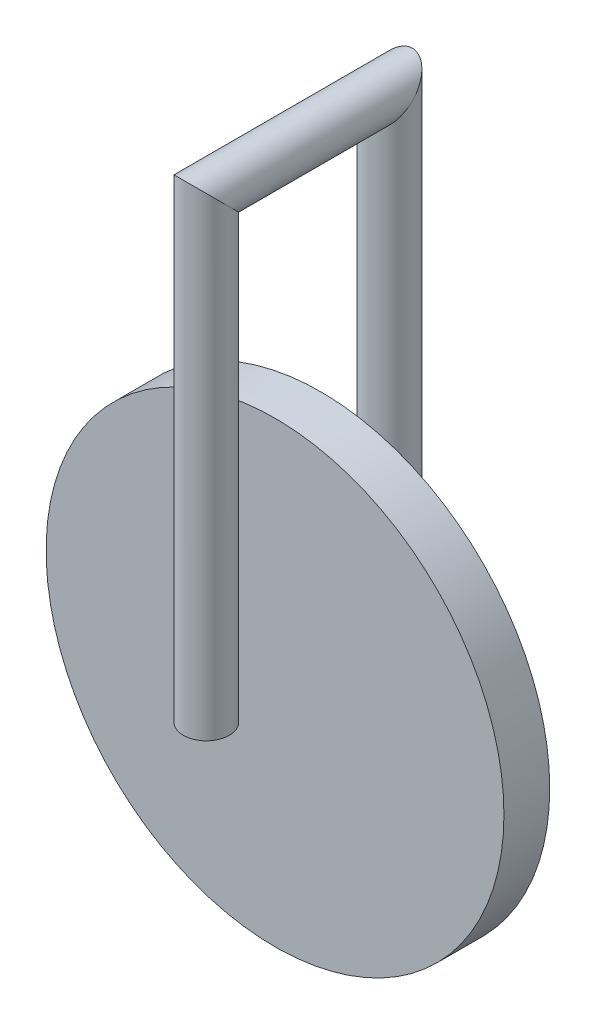
ISO-10303-21;
HEADER;
FILE_DESCRIPTION(('STEP AP214'),'2;1');
FILE_NAME('part.step','',(''),(''),'','','');
FILE_SCHEMA(('AUTOMOTIVE_DESIGN { 1 0 10303 214 1 1 1 1 }'));
ENDSEC;
DATA;
#1=APPLICATION_CONTEXT('core data for automotive mechanical design processes');
#2=APPLICATION_PROTOCOL_DEFINITION('international standard','automotive_design',2000,#1);
#3=PRODUCT_CONTEXT('',#1,'mechanical');
#4=PRODUCT('Part','Part','',(#3));
#5=PRODUCT_RELATED_PRODUCT_CATEGORY('part','',(#4));
#6=PRODUCT_DEFINITION_FORMATION('','',#4);
#7=PRODUCT_DEFINITION_CONTEXT('part definition',#1,'design');
#8=PRODUCT_DEFINITION('design','',#6,#7);
#9=PRODUCT_DEFINITION_SHAPE('','',#8);
#10=(LENGTH_UNIT() NAMED_UNIT(*) SI_UNIT(.MILLI.,.METRE.));
#11=(NAMED_UNIT(*) PLANE_ANGLE_UNIT() SI_UNIT($,.RADIAN.));
#12=(NAMED_UNIT(*) SI_UNIT($,.STERADIAN.) SOLID_ANGLE_UNIT());
#13=UNCERTAINTY_MEASURE_WITH_UNIT(LENGTH_MEASURE(1.E-05),#10,'distance_accuracy_value','');
#14=(GEOMETRIC_REPRESENTATION_CONTEXT(3) GLOBAL_UNCERTAINTY_ASSIGNED_CONTEXT((#13)) GLOBAL_UNIT_ASSIGNED_CONTEXT((#10,
#11,#12)) REPRESENTATION_CONTEXT('',''));
#15=CARTESIAN_POINT('',(0.,0.,0.));
#16=DIRECTION('',(0.,0.,1.));
#17=DIRECTION('',(1.,0.,0.));
#18=AXIS2_PLACEMENT_3D('',#15,#16,#17);
#19=CARTESIAN_POINT('',(0.,0.,-20.));
#20=DIRECTION('',(0.,1.,0.));
#21=DIRECTION('',(0.,0.,1.));
#22=AXIS2_PLACEMENT_3D('',#19,#20,#21);
#23=PLANE('',#22);
#24=CARTESIAN_POINT('',(0.,0.,-20.));
#25=DIRECTION('',(0.,1.,0.));
#26=DIRECTION('',(0.,0.,1.));
#27=AXIS2_PLACEMENT_3D('',#24,#25,#26);
#28=CIRCLE('',#27,5.);
#29=CARTESIAN_POINT('',(0.,0.,-15.));
#30=VERTEX_POINT('',#29);
#31=EDGE_CURVE('E50',#30,#30,#28,.T.);
#32=ORIENTED_EDGE('',*,*,#31,.F.);
#33=EDGE_LOOP('',(#32));
#34=FACE_BOUND('',#33,.T.);
#35=ADVANCED_FACE('F47',(#34),#23,.F.);
#36=CARTESIAN_POINT('',(0.,0.,20.));
#37=DIRECTION('',(0.,-1.,0.));
#38=DIRECTION('',(0.,0.,-1.));
#39=AXIS2_PLACEMENT_3D('',#36,#37,#38);
#40=PLANE('',#39);
#41=CARTESIAN_POINT('',(0.,0.,20.));
#42=DIRECTION('',(0.,-1.,0.));
#43=DIRECTION('',(0.,0.,-1.));
#44=AXIS2_PLACEMENT_3D('',#41,#42,#43);
#45=CIRCLE('',#44,5.);
#46=CARTESIAN_POINT('',(0.,0.,15.));
#47=VERTEX_POINT('',#46);
#48=EDGE_CURVE('E54',#47,#47,#45,.T.);
#49=ORIENTED_EDGE('',*,*,#48,.T.);
#50=EDGE_LOOP('',(#49));
#51=FACE_BOUND('',#50,.T.);
#52=ADVANCED_FACE('F70',(#51),#40,.T.);
#53=CARTESIAN_POINT('',(0.,105.6,-20.));
#54=DIRECTION('',(0.,-1.,0.));
#55=DIRECTION('',(0.,0.,-1.));
#56=AXIS2_PLACEMENT_3D('',#53,#54,#55);
#57=CYLINDRICAL_SURFACE('',#56,5.);
#58=CARTESIAN_POINT('',(0.,100.,-20.));
#59=DIRECTION('',(0.,-0.707106781186547,-0.707106781186548));
#60=DIRECTION('',(0.,0.707106781186548,-0.707106781186547));
#61=AXIS2_PLACEMENT_3D('',#58,#59,#60);
#62=ELLIPSE('',#61,7.07106781186547,5.);
#63=CARTESIAN_POINT('',(0.,105.,-25.));
#64=VERTEX_POINT('',#63);
#65=EDGE_CURVE('E59',#64,#64,#62,.T.);
#66=ORIENTED_EDGE('',*,*,#65,.T.);
#67=EDGE_LOOP('',(#66));
#68=FACE_BOUND('',#67,.T.);
#69=ORIENTED_EDGE('',*,*,#31,.T.);
#70=EDGE_LOOP('',(#69));
#71=FACE_BOUND('',#70,.T.);
#72=ADVANCED_FACE('F67',(#68,#71),#57,.T.);
#73=CARTESIAN_POINT('',(0.,100.,25.6));
#74=DIRECTION('',(0.,0.,-1.));
#75=DIRECTION('',(-1.,0.,0.));
#76=AXIS2_PLACEMENT_3D('',#73,#74,#75);
#77=CYLINDRICAL_SURFACE('',#76,5.);
#78=CARTESIAN_POINT('',(0.,100.,20.));
#79=DIRECTION('',(0.,0.707106781186548,-0.707106781186548));
#80=DIRECTION('',(0.,0.707106781186548,0.707106781186548));
#81=AXIS2_PLACEMENT_3D('',#78,#79,#80);
#82=ELLIPSE('',#81,7.07106781186547,5.);
#83=CARTESIAN_POINT('',(0.,105.,25.));
#84=VERTEX_POINT('',#83);
#85=EDGE_CURVE('E12',#84,#84,#82,.T.);
#86=ORIENTED_EDGE('',*,*,#85,.T.);
#87=EDGE_LOOP('',(#86));
#88=FACE_BOUND('',#87,.T.);
#89=ORIENTED_EDGE('',*,*,#65,.F.);
#90=EDGE_LOOP('',(#89));
#91=FACE_BOUND('',#90,.T.);
#92=ADVANCED_FACE('F77',(#88,#91),#77,.T.);
#93=CARTESIAN_POINT('',(0.,0.,20.));
#94=DIRECTION('',(0.,1.,0.));
#95=DIRECTION('',(0.,0.,1.));
#96=AXIS2_PLACEMENT_3D('',#93,#94,#95);
#97=CYLINDRICAL_SURFACE('',#96,5.);
#98=ORIENTED_EDGE('',*,*,#48,.F.);
#99=EDGE_LOOP('',(#98));
#100=FACE_BOUND('',#99,.T.);
#101=ORIENTED_EDGE('',*,*,#85,.F.);
#102=EDGE_LOOP('',(#101));
#103=FACE_BOUND('',#102,.T.);
#104=ADVANCED_FACE('F75',(#100,#103),#97,.T.);
#105=CLOSED_SHELL('',(#35,#52,#72,#92,#104));
#106=MANIFOLD_SOLID_BREP('B2',#105);
#107=CARTESIAN_POINT('',(0.,0.,5.));
#108=DIRECTION('',(0.,0.,-1.));
#109=DIRECTION('',(-1.,0.,0.));
#110=AXIS2_PLACEMENT_3D('',#107,#108,#109);
#111=CYLINDRICAL_SURFACE('',#110,50.);
#112=CARTESIAN_POINT('',(0.,0.,5.));
#113=DIRECTION('',(0.,0.,1.));
#114=DIRECTION('',(1.,0.,0.));
#115=AXIS2_PLACEMENT_3D('',#112,#113,#114);
#116=CIRCLE('',#115,50.);
#117=CARTESIAN_POINT('',(50.,0.,5.));
#118=VERTEX_POINT('',#117);
#119=EDGE_CURVE('E46',#118,#118,#116,.T.);
#120=ORIENTED_EDGE('',*,*,#119,.F.);
#121=EDGE_LOOP('',(#120));
#122=FACE_BOUND('',#121,.T.);
#123=CARTESIAN_POINT('',(0.,0.,-5.));
#124=DIRECTION('',(0.,0.,1.));
#125=DIRECTION('',(1.,0.,0.));
#126=AXIS2_PLACEMENT_3D('',#123,#124,#125);
#127=CIRCLE('',#126,50.);
#128=CARTESIAN_POINT('',(50.,0.,-5.));
#129=VERTEX_POINT('',#128);
#130=EDGE_CURVE('E121',#129,#129,#127,.T.);
#131=ORIENTED_EDGE('',*,*,#130,.T.);
#132=EDGE_LOOP('',(#131));
#133=FACE_BOUND('',#132,.T.);
#134=ADVANCED_FACE('F118',(#122,#133),#111,.T.);
#135=CARTESIAN_POINT('',(0.,0.,5.));
#136=DIRECTION('',(0.,0.,1.));
#137=DIRECTION('',(1.,0.,0.));
#138=AXIS2_PLACEMENT_3D('',#135,#136,#137);
#139=PLANE('',#138);
#140=ORIENTED_EDGE('',*,*,#119,.T.);
#141=EDGE_LOOP('',(#140));
#142=FACE_BOUND('',#141,.T.);
#143=ADVANCED_FACE('F133',(#142),#139,.T.);
#144=CARTESIAN_POINT('',(0.,0.,-5.));
#145=DIRECTION('',(0.,0.,1.));
#146=DIRECTION('',(1.,0.,0.));
#147=AXIS2_PLACEMENT_3D('',#144,#145,#146);
#148=PLANE('',#147);
#149=ORIENTED_EDGE('',*,*,#130,.F.);
#150=EDGE_LOOP('',(#149));
#151=FACE_BOUND('',#150,.T.);
#152=ADVANCED_FACE('F131',(#151),#148,.F.);
#153=CLOSED_SHELL('',(#134,#143,#152));
#154=MANIFOLD_SOLID_BREP('B7',#153);
#155=ADVANCED_BREP_SHAPE_REPRESENTATION('',(#18,#106,#154),#14);
#156=SHAPE_DEFINITION_REPRESENTATION(#9,#155);
ENDSEC;
END-ISO-10303-21;
